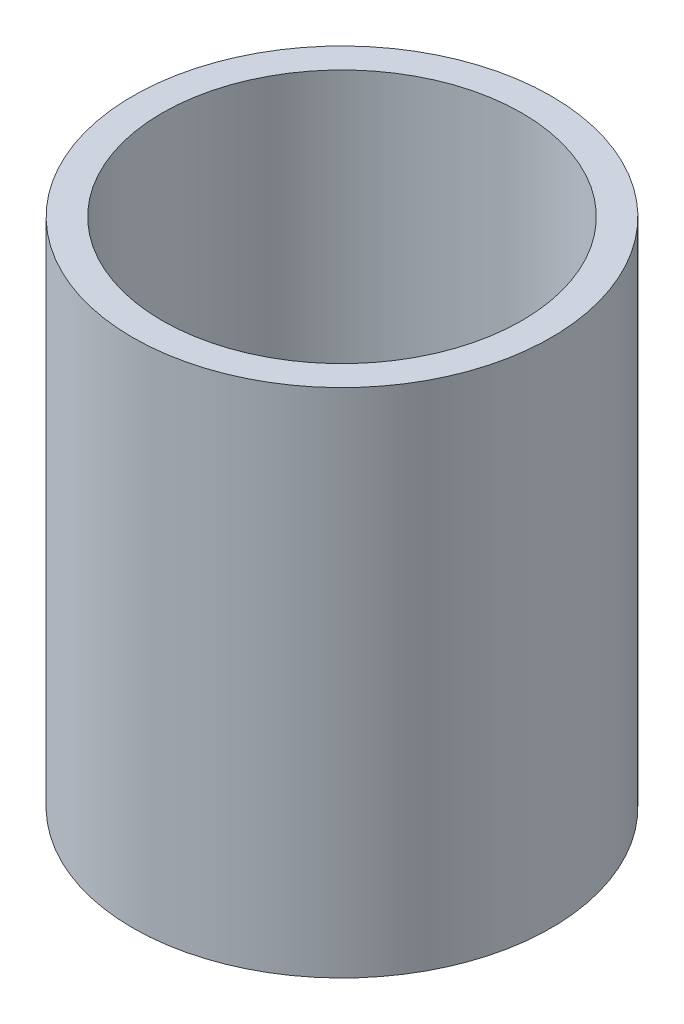
ISO-10303-21;
HEADER;
FILE_DESCRIPTION(('STEP AP214'),'2;1');
FILE_NAME('part.step','',(''),(''),'','','');
FILE_SCHEMA(('AUTOMOTIVE_DESIGN { 1 0 10303 214 1 1 1 1 }'));
ENDSEC;
DATA;
#1=APPLICATION_CONTEXT('core data for automotive mechanical design processes');
#2=APPLICATION_PROTOCOL_DEFINITION('international standard','automotive_design',2000,#1);
#3=PRODUCT_CONTEXT('',#1,'mechanical');
#4=PRODUCT('Part','Part','',(#3));
#5=PRODUCT_RELATED_PRODUCT_CATEGORY('part','',(#4));
#6=PRODUCT_DEFINITION_FORMATION('','',#4);
#7=PRODUCT_DEFINITION_CONTEXT('part definition',#1,'design');
#8=PRODUCT_DEFINITION('design','',#6,#7);
#9=PRODUCT_DEFINITION_SHAPE('','',#8);
#10=(LENGTH_UNIT() NAMED_UNIT(*) SI_UNIT(.MILLI.,.METRE.));
#11=(NAMED_UNIT(*) PLANE_ANGLE_UNIT() SI_UNIT($,.RADIAN.));
#12=(NAMED_UNIT(*) SI_UNIT($,.STERADIAN.) SOLID_ANGLE_UNIT());
#13=UNCERTAINTY_MEASURE_WITH_UNIT(LENGTH_MEASURE(1.E-05),#10,'distance_accuracy_value','');
#14=(GEOMETRIC_REPRESENTATION_CONTEXT(3) GLOBAL_UNCERTAINTY_ASSIGNED_CONTEXT((#13)) GLOBAL_UNIT_ASSIGNED_CONTEXT((#10,
#11,#12)) REPRESENTATION_CONTEXT('',''));
#15=CARTESIAN_POINT('',(0.,0.,0.));
#16=DIRECTION('',(0.,0.,1.));
#17=DIRECTION('',(1.,0.,0.));
#18=AXIS2_PLACEMENT_3D('',#15,#16,#17);
#19=CARTESIAN_POINT('',(0.,61.0964317776923,0.));
#20=DIRECTION('',(0.,-1.,0.));
#21=DIRECTION('',(0.,0.,-1.));
#22=AXIS2_PLACEMENT_3D('',#19,#20,#21);
#23=CYLINDRICAL_SURFACE('',#22,25.);
#24=CARTESIAN_POINT('',(0.,61.0964317776923,0.));
#25=DIRECTION('',(0.,1.,0.));
#26=DIRECTION('',(0.,0.,1.));
#27=AXIS2_PLACEMENT_3D('',#24,#25,#26);
#28=CIRCLE('',#27,25.);
#29=CARTESIAN_POINT('',(0.,61.0964317776923,25.));
#30=VERTEX_POINT('',#29);
#31=EDGE_CURVE('E10',#30,#30,#28,.T.);
#32=ORIENTED_EDGE('',*,*,#31,.F.);
#33=EDGE_LOOP('',(#32));
#34=FACE_BOUND('',#33,.T.);
#35=CARTESIAN_POINT('',(0.,0.,0.));
#36=DIRECTION('',(0.,1.,0.));
#37=DIRECTION('',(0.,0.,1.));
#38=AXIS2_PLACEMENT_3D('',#35,#36,#37);
#39=CIRCLE('',#38,25.);
#40=CARTESIAN_POINT('',(0.,0.,25.));
#41=VERTEX_POINT('',#40);
#42=EDGE_CURVE('E37',#41,#41,#39,.T.);
#43=ORIENTED_EDGE('',*,*,#42,.T.);
#44=EDGE_LOOP('',(#43));
#45=FACE_BOUND('',#44,.T.);
#46=ADVANCED_FACE('F40',(#34,#45),#23,.T.);
#47=CARTESIAN_POINT('',(0.,61.0964317776923,0.));
#48=DIRECTION('',(0.,1.,0.));
#49=DIRECTION('',(0.,0.,1.));
#50=AXIS2_PLACEMENT_3D('',#47,#48,#49);
#51=PLANE('',#50);
#52=CARTESIAN_POINT('',(0.,61.0964317776923,0.));
#53=DIRECTION('',(0.,1.,0.));
#54=DIRECTION('',(0.,0.,1.));
#55=AXIS2_PLACEMENT_3D('',#52,#53,#54);
#56=CIRCLE('',#55,21.4916101504963);
#57=CARTESIAN_POINT('',(0.,61.0964317776923,21.4916101504963));
#58=VERTEX_POINT('',#57);
#59=EDGE_CURVE('E50',#58,#58,#56,.T.);
#60=ORIENTED_EDGE('',*,*,#59,.F.);
#61=EDGE_LOOP('',(#60));
#62=FACE_BOUND('',#61,.T.);
#63=ORIENTED_EDGE('',*,*,#31,.T.);
#64=EDGE_LOOP('',(#63));
#65=FACE_BOUND('',#64,.T.);
#66=ADVANCED_FACE('F59',(#62,#65),#51,.T.);
#67=CARTESIAN_POINT('',(0.,0.,0.));
#68=DIRECTION('',(0.,1.,0.));
#69=DIRECTION('',(0.,0.,1.));
#70=AXIS2_PLACEMENT_3D('',#67,#68,#69);
#71=PLANE('',#70);
#72=CARTESIAN_POINT('',(0.,0.,0.));
#73=DIRECTION('',(0.,1.,0.));
#74=DIRECTION('',(0.,0.,1.));
#75=AXIS2_PLACEMENT_3D('',#72,#73,#74);
#76=CIRCLE('',#75,21.4916101504963);
#77=CARTESIAN_POINT('',(0.,0.,21.4916101504963));
#78=VERTEX_POINT('',#77);
#79=EDGE_CURVE('E47',#78,#78,#76,.T.);
#80=ORIENTED_EDGE('',*,*,#79,.T.);
#81=EDGE_LOOP('',(#80));
#82=FACE_BOUND('',#81,.T.);
#83=ORIENTED_EDGE('',*,*,#42,.F.);
#84=EDGE_LOOP('',(#83));
#85=FACE_BOUND('',#84,.T.);
#86=ADVANCED_FACE('F58',(#82,#85),#71,.F.);
#87=CARTESIAN_POINT('',(0.,61.0964317776923,0.));
#88=DIRECTION('',(0.,-1.,0.));
#89=DIRECTION('',(0.,0.,-1.));
#90=AXIS2_PLACEMENT_3D('',#87,#88,#89);
#91=CYLINDRICAL_SURFACE('',#90,21.4916101504963);
#92=ORIENTED_EDGE('',*,*,#59,.T.);
#93=EDGE_LOOP('',(#92));
#94=FACE_BOUND('',#93,.T.);
#95=ORIENTED_EDGE('',*,*,#79,.F.);
#96=EDGE_LOOP('',(#95));
#97=FACE_BOUND('',#96,.T.);
#98=ADVANCED_FACE('F54',(#94,#97),#91,.F.);
#99=CLOSED_SHELL('',(#46,#66,#86,#98));
#100=MANIFOLD_SOLID_BREP('B2',#99);
#101=ADVANCED_BREP_SHAPE_REPRESENTATION('',(#18,#100),#14);
#102=SHAPE_DEFINITION_REPRESENTATION(#9,#101);
ENDSEC;
END-ISO-10303-21;
